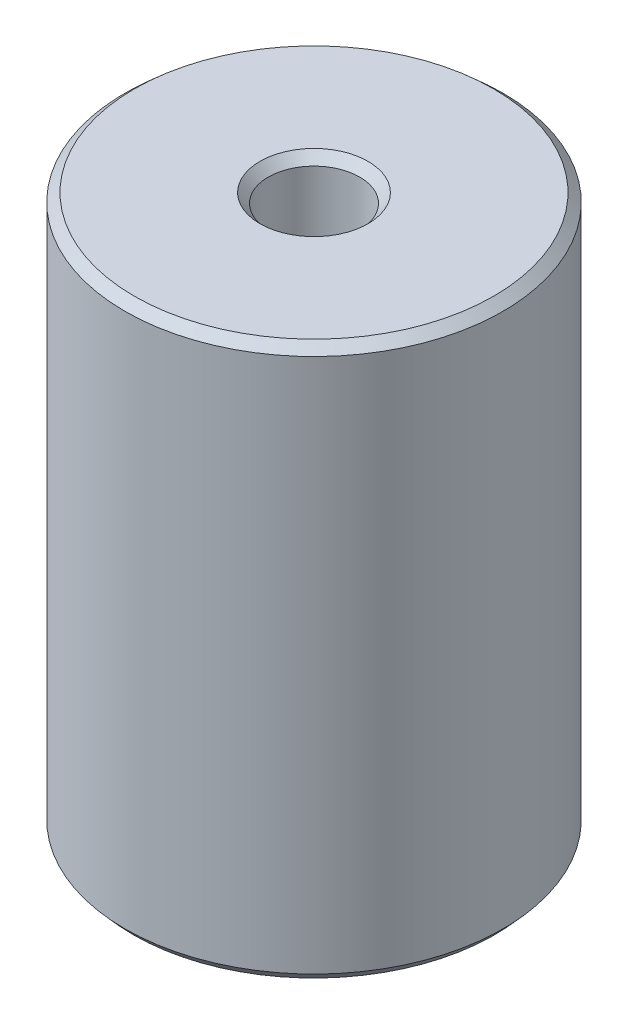
ISO-10303-21;
HEADER;
FILE_DESCRIPTION(('STEP AP214'),'2;1');
FILE_NAME('part.step','',(''),(''),'','','');
FILE_SCHEMA(('AUTOMOTIVE_DESIGN { 1 0 10303 214 1 1 1 1 }'));
ENDSEC;
DATA;
#1=APPLICATION_CONTEXT('core data for automotive mechanical design processes');
#2=APPLICATION_PROTOCOL_DEFINITION('international standard','automotive_design',2000,#1);
#3=PRODUCT_CONTEXT('',#1,'mechanical');
#4=PRODUCT('Part','Part','',(#3));
#5=PRODUCT_RELATED_PRODUCT_CATEGORY('part','',(#4));
#6=PRODUCT_DEFINITION_FORMATION('','',#4);
#7=PRODUCT_DEFINITION_CONTEXT('part definition',#1,'design');
#8=PRODUCT_DEFINITION('design','',#6,#7);
#9=PRODUCT_DEFINITION_SHAPE('','',#8);
#10=(LENGTH_UNIT() NAMED_UNIT(*) SI_UNIT(.MILLI.,.METRE.));
#11=(NAMED_UNIT(*) PLANE_ANGLE_UNIT() SI_UNIT($,.RADIAN.));
#12=(NAMED_UNIT(*) SI_UNIT($,.STERADIAN.) SOLID_ANGLE_UNIT());
#13=UNCERTAINTY_MEASURE_WITH_UNIT(LENGTH_MEASURE(1.E-05),#10,'distance_accuracy_value','');
#14=(GEOMETRIC_REPRESENTATION_CONTEXT(3) GLOBAL_UNCERTAINTY_ASSIGNED_CONTEXT((#13)) GLOBAL_UNIT_ASSIGNED_CONTEXT((#10,
#11,#12)) REPRESENTATION_CONTEXT('',''));
#15=CARTESIAN_POINT('',(0.,0.,0.));
#16=DIRECTION('',(0.,0.,1.));
#17=DIRECTION('',(1.,0.,0.));
#18=AXIS2_PLACEMENT_3D('',#15,#16,#17);
#19=CARTESIAN_POINT('',(0.,14.6188380022093,0.));
#20=DIRECTION('',(0.,-1.,0.));
#21=DIRECTION('',(0.,0.,-1.));
#22=AXIS2_PLACEMENT_3D('',#19,#20,#21);
#23=CYLINDRICAL_SURFACE('',#22,5.);
#24=CARTESIAN_POINT('',(0.,0.248153867948794,0.));
#25=DIRECTION('',(0.,1.,0.));
#26=DIRECTION('',(0.,0.,1.));
#27=AXIS2_PLACEMENT_3D('',#24,#25,#26);
#28=CIRCLE('',#27,5.);
#29=CARTESIAN_POINT('',(0.,0.248153867948792,-5.));
#30=VERTEX_POINT('',#29);
#31=EDGE_CURVE('E10',#30,#30,#28,.T.);
#32=CARTESIAN_POINT('',(0.,14.3967151553673,0.));
#33=DIRECTION('',(0.,1.,0.));
#34=DIRECTION('',(0.,0.,1.));
#35=AXIS2_PLACEMENT_3D('',#32,#33,#34);
#36=CIRCLE('',#35,5.);
#37=CARTESIAN_POINT('',(0.,14.3967151553673,-5.));
#38=VERTEX_POINT('',#37);
#39=EDGE_CURVE('E50',#38,#38,#36,.F.);
#40=CARTESIAN_POINT('',(0.,0.248153867948792,-5.));
#41=CARTESIAN_POINT('',(0.,0.395534714692735,-5.));
#42=CARTESIAN_POINT('',(0.,0.542915561436678,-5.));
#43=CARTESIAN_POINT('',(0.,0.837677254924564,-5.));
#44=CARTESIAN_POINT('',(0.,0.985058101668506,-5.));
#45=CARTESIAN_POINT('',(0.,1.27981979515639,-5.));
#46=CARTESIAN_POINT('',(0.,1.42720064190033,-5.));
#47=CARTESIAN_POINT('',(0.,1.72196233538822,-5.));
#48=CARTESIAN_POINT('',(0.,1.86934318213216,-5.));
#49=CARTESIAN_POINT('',(0.,2.16410487562005,-5.));
#50=CARTESIAN_POINT('',(0.,2.31148572236399,-5.));
#51=CARTESIAN_POINT('',(0.,2.60624741585188,-5.));
#52=CARTESIAN_POINT('',(0.,2.75362826259582,-5.));
#53=CARTESIAN_POINT('',(0.,3.04838995608371,-5.));
#54=CARTESIAN_POINT('',(0.,3.19577080282765,-5.));
#55=CARTESIAN_POINT('',(0.,3.49053249631553,-5.));
#56=CARTESIAN_POINT('',(0.,3.63791334305948,-5.));
#57=CARTESIAN_POINT('',(0.,3.93267503654736,-5.));
#58=CARTESIAN_POINT('',(0.,4.08005588329131,-5.));
#59=CARTESIAN_POINT('',(0.,4.37481757677919,-5.));
#60=CARTESIAN_POINT('',(0.,4.52219842352314,-5.));
#61=CARTESIAN_POINT('',(0.,4.81696011701102,-5.));
#62=CARTESIAN_POINT('',(0.,4.96434096375496,-5.));
#63=CARTESIAN_POINT('',(0.,5.25910265724285,-5.));
#64=CARTESIAN_POINT('',(0.,5.40648350398679,-5.));
#65=CARTESIAN_POINT('',(0.,5.70124519747468,-5.));
#66=CARTESIAN_POINT('',(0.,5.84862604421862,-5.));
#67=CARTESIAN_POINT('',(0.,6.14338773770651,-5.));
#68=CARTESIAN_POINT('',(0.,6.29076858445045,-5.));
#69=CARTESIAN_POINT('',(0.,6.58553027793834,-5.));
#70=CARTESIAN_POINT('',(0.,6.73291112468228,-5.));
#71=CARTESIAN_POINT('',(0.,7.02767281817016,-5.));
#72=CARTESIAN_POINT('',(0.,7.17505366491411,-5.));
#73=CARTESIAN_POINT('',(0.,7.46981535840199,-5.));
#74=CARTESIAN_POINT('',(0.,7.61719620514594,-5.));
#75=CARTESIAN_POINT('',(0.,7.91195789863382,-5.));
#76=CARTESIAN_POINT('',(0.,8.05933874537776,-5.));
#77=CARTESIAN_POINT('',(0.,8.35410043886565,-5.));
#78=CARTESIAN_POINT('',(0.,8.50148128560959,-5.));
#79=CARTESIAN_POINT('',(0.,8.79624297909748,-5.));
#80=CARTESIAN_POINT('',(0.,8.94362382584142,-5.));
#81=CARTESIAN_POINT('',(0.,9.23838551932931,-5.));
#82=CARTESIAN_POINT('',(0.,9.38576636607325,-5.));
#83=CARTESIAN_POINT('',(0.,9.68052805956114,-5.));
#84=CARTESIAN_POINT('',(0.,9.82790890630508,-5.));
#85=CARTESIAN_POINT('',(0.,10.122670599793,-5.));
#86=CARTESIAN_POINT('',(0.,10.2700514465369,-5.));
#87=CARTESIAN_POINT('',(0.,10.5648131400248,-5.));
#88=CARTESIAN_POINT('',(0.,10.7121939867687,-5.));
#89=CARTESIAN_POINT('',(0.,11.0069556802566,-5.));
#90=CARTESIAN_POINT('',(0.,11.1543365270006,-5.));
#91=CARTESIAN_POINT('',(0.,11.4490982204884,-5.));
#92=CARTESIAN_POINT('',(0.,11.5964790672324,-5.));
#93=CARTESIAN_POINT('',(0.,11.8912407607203,-5.));
#94=CARTESIAN_POINT('',(0.,12.0386216074642,-5.));
#95=CARTESIAN_POINT('',(0.,12.3333833009521,-5.));
#96=CARTESIAN_POINT('',(0.,12.480764147696,-5.));
#97=CARTESIAN_POINT('',(0.,12.7755258411839,-5.));
#98=CARTESIAN_POINT('',(0.,12.9229066879279,-5.));
#99=CARTESIAN_POINT('',(0.,13.2176683814158,-5.));
#100=CARTESIAN_POINT('',(0.,13.3650492281597,-5.));
#101=CARTESIAN_POINT('',(0.,13.6598109216476,-5.));
#102=CARTESIAN_POINT('',(0.,13.8071917683915,-5.));
#103=CARTESIAN_POINT('',(0.,14.1019534618794,-5.));
#104=CARTESIAN_POINT('',(0.,14.2493343086234,-5.));
#105=CARTESIAN_POINT('',(0.,14.3967151553673,-5.));
#106=B_SPLINE_CURVE_WITH_KNOTS('',3,(#40,#41,#42,#43,#44,#45,#46,#47,#48,#49,#50,#51,#52,#53,
#54,#55,#56,#57,#58,#59,#60,#61,#62,#63,#64,#65,#66,#67,#68,#69,#70,#71,#72,#73,#74,#75,#76,#77,
#78,#79,#80,#81,#82,#83,#84,#85,#86,#87,#88,#89,#90,#91,#92,#93,#94,#95,#96,#97,#98,#99,#100,
#101,#102,#103,#104,#105),.UNSPECIFIED.,.F.,.F.,(4,2,2,2,2,2,2,2,2,2,2,2,2,2,2,2,2,2,2,2,2,2,2,
2,2,2,2,2,2,2,2,2,4),(0.,0.442142540231829,0.884285080463657,1.32642762069549,1.76857016092732,
2.21071270115914,2.65285524139097,3.0949977816228,3.53714032185463,3.97928286208646,
4.42142540231829,4.86356794255012,5.30571048278194,5.74785302301377,6.1899955632456,
6.63213810347743,7.07428064370926,7.51642318394109,7.95856572417292,8.40070826440474,
8.84285080463657,9.2849933448684,9.72713588510023,10.1692784253321,10.6114209655639,
11.0535635057957,11.4957060460275,11.9378485862594,12.3799911264912,12.822133666723,
13.2642762069549,13.7064187471867,14.1485612874185),.UNSPECIFIED.);
#107=EDGE_CURVE('BSEAM39',#30,#38,#106,.T.);
#108=ORIENTED_EDGE('',*,*,#31,.T.);
#109=ORIENTED_EDGE('',*,*,#39,.T.);
#110=ORIENTED_EDGE('',*,*,#107,.T.);
#111=ORIENTED_EDGE('',*,*,#107,.F.);
#112=EDGE_LOOP('',(#108,#110,#109,#111));
#113=FACE_BOUND('',#112,.T.);
#114=ADVANCED_FACE('F39',(#113),#23,.T.);
#115=CARTESIAN_POINT('',(0.,14.6188380022093,0.));
#116=DIRECTION('',(0.,1.,0.));
#117=DIRECTION('',(0.,0.,1.));
#118=AXIS2_PLACEMENT_3D('',#115,#116,#117);
#119=PLANE('',#118);
#120=CARTESIAN_POINT('',(0.,14.6188380022093,0.));
#121=DIRECTION('',(0.,1.,0.));
#122=DIRECTION('',(0.,0.,1.));
#123=AXIS2_PLACEMENT_3D('',#120,#121,#122);
#124=CIRCLE('',#123,1.42981353982798);
#125=CARTESIAN_POINT('',(0.,14.6188380022093,1.42981353982798));
#126=VERTEX_POINT('',#125);
#127=EDGE_CURVE('E58',#126,#126,#124,.F.);
#128=ORIENTED_EDGE('',*,*,#127,.T.);
#129=EDGE_LOOP('',(#128));
#130=FACE_BOUND('',#129,.T.);
#131=CARTESIAN_POINT('',(0.,14.6188380022093,0.));
#132=DIRECTION('',(0.,1.,0.));
#133=DIRECTION('',(0.,0.,1.));
#134=AXIS2_PLACEMENT_3D('',#131,#132,#133);
#135=CIRCLE('',#134,4.75184613205123);
#136=CARTESIAN_POINT('',(0.,14.6188380022093,-4.75184613205123));
#137=VERTEX_POINT('',#136);
#138=EDGE_CURVE('E61',#137,#137,#135,.T.);
#139=ORIENTED_EDGE('',*,*,#138,.T.);
#140=EDGE_LOOP('',(#139));
#141=FACE_BOUND('',#140,.T.);
#142=ADVANCED_FACE('F88',(#130,#141),#119,.T.);
#143=CARTESIAN_POINT('',(0.,0.,0.));
#144=DIRECTION('',(0.,1.,0.));
#145=DIRECTION('',(0.,0.,1.));
#146=AXIS2_PLACEMENT_3D('',#143,#144,#145);
#147=PLANE('',#146);
#148=CARTESIAN_POINT('',(0.,0.,0.));
#149=DIRECTION('',(0.,1.,0.));
#150=DIRECTION('',(0.,0.,1.));
#151=AXIS2_PLACEMENT_3D('',#148,#149,#150);
#152=CIRCLE('',#151,1.45584456093472);
#153=CARTESIAN_POINT('',(0.,0.,1.45584456093472));
#154=VERTEX_POINT('',#153);
#155=EDGE_CURVE('E51',#154,#154,#152,.T.);
#156=ORIENTED_EDGE('',*,*,#155,.T.);
#157=EDGE_LOOP('',(#156));
#158=FACE_BOUND('',#157,.T.);
#159=CARTESIAN_POINT('',(0.,0.,0.));
#160=DIRECTION('',(0.,1.,0.));
#161=DIRECTION('',(0.,0.,1.));
#162=AXIS2_PLACEMENT_3D('',#159,#160,#161);
#163=CIRCLE('',#162,4.77787715315795);
#164=CARTESIAN_POINT('',(0.,0.,4.77787715315795));
#165=VERTEX_POINT('',#164);
#166=EDGE_CURVE('E54',#165,#165,#163,.F.);
#167=ORIENTED_EDGE('',*,*,#166,.T.);
#168=EDGE_LOOP('',(#167));
#169=FACE_BOUND('',#168,.T.);
#170=ADVANCED_FACE('F83',(#158,#169),#147,.F.);
#171=CARTESIAN_POINT('',(0.,14.6188380022093,0.));
#172=DIRECTION('',(0.,-1.,0.));
#173=DIRECTION('',(0.,0.,-1.));
#174=AXIS2_PLACEMENT_3D('',#171,#172,#173);
#175=CYLINDRICAL_SURFACE('',#174,1.20769069298594);
#176=CARTESIAN_POINT('',(0.,14.3706841342606,0.));
#177=DIRECTION('',(0.,1.,0.));
#178=DIRECTION('',(0.,0.,1.));
#179=AXIS2_PLACEMENT_3D('',#176,#177,#178);
#180=CIRCLE('',#179,1.20769069298594);
#181=CARTESIAN_POINT('',(0.,14.3706841342606,-1.20769069298594));
#182=VERTEX_POINT('',#181);
#183=EDGE_CURVE('E67',#182,#182,#180,.T.);
#184=CARTESIAN_POINT('',(0.,0.222122846842039,0.));
#185=DIRECTION('',(0.,1.,0.));
#186=DIRECTION('',(0.,0.,1.));
#187=AXIS2_PLACEMENT_3D('',#184,#185,#186);
#188=CIRCLE('',#187,1.20769069298594);
#189=CARTESIAN_POINT('',(0.,0.222122846842037,-1.20769069298594));
#190=VERTEX_POINT('',#189);
#191=EDGE_CURVE('E69',#190,#190,#188,.F.);
#192=CARTESIAN_POINT('',(0.,14.3706841342606,-1.20769069298594));
#193=CARTESIAN_POINT('',(0.,14.2233032875166,-1.20769069298594));
#194=CARTESIAN_POINT('',(0.,14.0759224407727,-1.20769069298594));
#195=CARTESIAN_POINT('',(0.,13.7811607472848,-1.20769069298594));
#196=CARTESIAN_POINT('',(0.,13.6337799005408,-1.20769069298594));
#197=CARTESIAN_POINT('',(0.,13.339018207053,-1.20769069298594));
#198=CARTESIAN_POINT('',(0.,13.191637360309,-1.20769069298594));
#199=CARTESIAN_POINT('',(0.,12.8968756668211,-1.20769069298594));
#200=CARTESIAN_POINT('',(0.,12.7494948200772,-1.20769069298594));
#201=CARTESIAN_POINT('',(0.,12.4547331265893,-1.20769069298594));
#202=CARTESIAN_POINT('',(0.,12.3073522798454,-1.20769069298594));
#203=CARTESIAN_POINT('',(0.,12.0125905863575,-1.20769069298594));
#204=CARTESIAN_POINT('',(0.,11.8652097396135,-1.20769069298594));
#205=CARTESIAN_POINT('',(0.,11.5704480461256,-1.20769069298594));
#206=CARTESIAN_POINT('',(0.,11.4230671993817,-1.20769069298594));
#207=CARTESIAN_POINT('',(0.,11.1283055058938,-1.20769069298594));
#208=CARTESIAN_POINT('',(0.,10.9809246591499,-1.20769069298594));
#209=CARTESIAN_POINT('',(0.,10.686162965662,-1.20769069298594));
#210=CARTESIAN_POINT('',(0.,10.538782118918,-1.20769069298594));
#211=CARTESIAN_POINT('',(0.,10.2440204254302,-1.20769069298594));
#212=CARTESIAN_POINT('',(0.,10.0966395786862,-1.20769069298594));
#213=CARTESIAN_POINT('',(0.,9.80187788519833,-1.20769069298594));
#214=CARTESIAN_POINT('',(0.,9.65449703845439,-1.20769069298594));
#215=CARTESIAN_POINT('',(0.,9.3597353449665,-1.20769069298594));
#216=CARTESIAN_POINT('',(0.,9.21235449822256,-1.20769069298594));
#217=CARTESIAN_POINT('',(0.,8.91759280473467,-1.20769069298594));
#218=CARTESIAN_POINT('',(0.,8.77021195799073,-1.20769069298594));
#219=CARTESIAN_POINT('',(0.,8.47545026450284,-1.20769069298594));
#220=CARTESIAN_POINT('',(0.,8.3280694177589,-1.20769069298594));
#221=CARTESIAN_POINT('',(0.,8.03330772427101,-1.20769069298594));
#222=CARTESIAN_POINT('',(0.,7.88592687752707,-1.20769069298594));
#223=CARTESIAN_POINT('',(0.,7.59116518403918,-1.20769069298594));
#224=CARTESIAN_POINT('',(0.,7.44378433729524,-1.20769069298594));
#225=CARTESIAN_POINT('',(0.,7.14902264380736,-1.20769069298594));
#226=CARTESIAN_POINT('',(0.,7.00164179706341,-1.20769069298594));
#227=CARTESIAN_POINT('',(0.,6.70688010357553,-1.20769069298594));
#228=CARTESIAN_POINT('',(0.,6.55949925683158,-1.20769069298594));
#229=CARTESIAN_POINT('',(0.,6.2647375633437,-1.20769069298594));
#230=CARTESIAN_POINT('',(0.,6.11735671659975,-1.20769069298594));
#231=CARTESIAN_POINT('',(0.,5.82259502311187,-1.20769069298594));
#232=CARTESIAN_POINT('',(0.,5.67521417636793,-1.20769069298594));
#233=CARTESIAN_POINT('',(0.,5.38045248288004,-1.20769069298594));
#234=CARTESIAN_POINT('',(0.,5.2330716361361,-1.20769069298594));
#235=CARTESIAN_POINT('',(0.,4.93830994264821,-1.20769069298594));
#236=CARTESIAN_POINT('',(0.,4.79092909590427,-1.20769069298594));
#237=CARTESIAN_POINT('',(0.,4.49616740241638,-1.20769069298594));
#238=CARTESIAN_POINT('',(0.,4.34878655567244,-1.20769069298594));
#239=CARTESIAN_POINT('',(0.,4.05402486218455,-1.20769069298594));
#240=CARTESIAN_POINT('',(0.,3.90664401544061,-1.20769069298594));
#241=CARTESIAN_POINT('',(0.,3.61188232195273,-1.20769069298594));
#242=CARTESIAN_POINT('',(0.,3.46450147520878,-1.20769069298594));
#243=CARTESIAN_POINT('',(0.,3.1697397817209,-1.20769069298594));
#244=CARTESIAN_POINT('',(0.,3.02235893497695,-1.20769069298594));
#245=CARTESIAN_POINT('',(0.,2.72759724148907,-1.20769069298594));
#246=CARTESIAN_POINT('',(0.,2.58021639474512,-1.20769069298594));
#247=CARTESIAN_POINT('',(0.,2.28545470125724,-1.20769069298594));
#248=CARTESIAN_POINT('',(0.,2.1380738545133,-1.20769069298594));
#249=CARTESIAN_POINT('',(0.,1.84331216102541,-1.20769069298594));
#250=CARTESIAN_POINT('',(0.,1.69593131428147,-1.20769069298594));
#251=CARTESIAN_POINT('',(0.,1.40116962079358,-1.20769069298594));
#252=CARTESIAN_POINT('',(0.,1.25378877404964,-1.20769069298594));
#253=CARTESIAN_POINT('',(0.,0.959027080561752,-1.20769069298594));
#254=CARTESIAN_POINT('',(0.,0.811646233817809,-1.20769069298594));
#255=CARTESIAN_POINT('',(0.,0.516884540329924,-1.20769069298594));
#256=CARTESIAN_POINT('',(0.,0.369503693585981,-1.20769069298594));
#257=CARTESIAN_POINT('',(0.,0.222122846842037,-1.20769069298594));
#258=B_SPLINE_CURVE_WITH_KNOTS('',3,(#192,#193,#194,#195,#196,#197,#198,#199,#200,#201,#202,
#203,#204,#205,#206,#207,#208,#209,#210,#211,#212,#213,#214,#215,#216,#217,#218,#219,#220,#221,
#222,#223,#224,#225,#226,#227,#228,#229,#230,#231,#232,#233,#234,#235,#236,#237,#238,#239,#240,
#241,#242,#243,#244,#245,#246,#247,#248,#249,#250,#251,#252,#253,#254,#255,#256,#257),
.UNSPECIFIED.,.F.,.F.,(4,2,2,2,2,2,2,2,2,2,2,2,2,2,2,2,2,2,2,2,2,2,2,2,2,2,2,2,2,2,2,2,4),(0.,
0.442142540231828,0.884285080463657,1.32642762069549,1.76857016092731,2.21071270115914,
2.65285524139097,3.0949977816228,3.53714032185463,3.97928286208646,4.42142540231829,
4.86356794255012,5.30571048278194,5.74785302301377,6.1899955632456,6.63213810347743,
7.07428064370926,7.51642318394109,7.95856572417292,8.40070826440475,8.84285080463657,
9.2849933448684,9.72713588510023,10.1692784253321,10.6114209655639,11.0535635057957,
11.4957060460275,11.9378485862594,12.3799911264912,12.822133666723,13.2642762069549,
13.7064187471867,14.1485612874185),.UNSPECIFIED.);
#259=EDGE_CURVE('BSEAM71',#182,#190,#258,.T.);
#260=ORIENTED_EDGE('',*,*,#183,.T.);
#261=ORIENTED_EDGE('',*,*,#191,.T.);
#262=ORIENTED_EDGE('',*,*,#259,.T.);
#263=ORIENTED_EDGE('',*,*,#259,.F.);
#264=EDGE_LOOP('',(#260,#262,#261,#263));
#265=FACE_BOUND('',#264,.T.);
#266=ADVANCED_FACE('F71',(#265),#175,.F.);
#267=CARTESIAN_POINT('',(0.,14.3706841342606,0.));
#268=DIRECTION('',(0.,1.,0.));
#269=DIRECTION('',(0.,0.,1.));
#270=AXIS2_PLACEMENT_3D('',#267,#268,#269);
#271=CONICAL_SURFACE('',#270,1.20769069298594,0.730102029184634);
#272=ORIENTED_EDGE('',*,*,#127,.F.);
#273=EDGE_LOOP('',(#272));
#274=FACE_BOUND('',#273,.T.);
#275=ORIENTED_EDGE('',*,*,#183,.F.);
#276=EDGE_LOOP('',(#275));
#277=FACE_BOUND('',#276,.T.);
#278=ADVANCED_FACE('F77',(#274,#277),#271,.F.);
#279=CARTESIAN_POINT('',(0.,0.,0.));
#280=DIRECTION('',(0.,-1.,0.));
#281=DIRECTION('',(0.,0.,-1.));
#282=AXIS2_PLACEMENT_3D('',#279,#280,#281);
#283=CONICAL_SURFACE('',#282,1.45584456093472,0.840694297610255);
#284=ORIENTED_EDGE('',*,*,#191,.F.);
#285=EDGE_LOOP('',(#284));
#286=FACE_BOUND('',#285,.T.);
#287=ORIENTED_EDGE('',*,*,#155,.F.);
#288=EDGE_LOOP('',(#287));
#289=FACE_BOUND('',#288,.T.);
#290=ADVANCED_FACE('F73',(#286,#289),#283,.F.);
#291=CARTESIAN_POINT('',(0.,0.248153867948794,0.));
#292=DIRECTION('',(0.,1.,0.));
#293=DIRECTION('',(0.,0.,1.));
#294=AXIS2_PLACEMENT_3D('',#291,#292,#293);
#295=CONICAL_SURFACE('',#294,5.,0.730102029184637);
#296=ORIENTED_EDGE('',*,*,#166,.F.);
#297=EDGE_LOOP('',(#296));
#298=FACE_BOUND('',#297,.T.);
#299=ORIENTED_EDGE('',*,*,#31,.F.);
#300=EDGE_LOOP('',(#299));
#301=FACE_BOUND('',#300,.T.);
#302=ADVANCED_FACE('F76',(#298,#301),#295,.T.);
#303=CARTESIAN_POINT('',(0.,14.6188380022093,0.));
#304=DIRECTION('',(0.,-1.,0.));
#305=DIRECTION('',(0.,0.,-1.));
#306=AXIS2_PLACEMENT_3D('',#303,#304,#305);
#307=CONICAL_SURFACE('',#306,4.75184613205123,0.840694297610264);
#308=CARTESIAN_POINT('',(0.,14.3967151553673,-5.));
#309=CARTESIAN_POINT('',(0.,14.3990289350219,-4.99741506387554));
#310=CARTESIAN_POINT('',(0.,14.4013427146765,-4.99483012775107));
#311=CARTESIAN_POINT('',(0.,14.4059702739857,-4.98966025550214));
#312=CARTESIAN_POINT('',(0.,14.4082840536403,-4.98707531937767));
#313=CARTESIAN_POINT('',(0.,14.4129116129495,-4.98190544712874));
#314=CARTESIAN_POINT('',(0.,14.4152253926041,-4.97932051100427));
#315=CARTESIAN_POINT('',(0.,14.4198529519134,-4.97415063875534));
#316=CARTESIAN_POINT('',(0.,14.422166731568,-4.97156570263087));
#317=CARTESIAN_POINT('',(0.,14.4267942908772,-4.96639583038194));
#318=CARTESIAN_POINT('',(0.,14.4291080705318,-4.96381089425747));
#319=CARTESIAN_POINT('',(0.,14.433735629841,-4.95864102200854));
#320=CARTESIAN_POINT('',(0.,14.4360494094956,-4.95605608588407));
#321=CARTESIAN_POINT('',(0.,14.4406769688048,-4.95088621363514));
#322=CARTESIAN_POINT('',(0.,14.4429907484594,-4.94830127751067));
#323=CARTESIAN_POINT('',(0.,14.4476183077686,-4.94313140526174));
#324=CARTESIAN_POINT('',(0.,14.4499320874232,-4.94054646913727));
#325=CARTESIAN_POINT('',(0.,14.4545596467324,-4.93537659688834));
#326=CARTESIAN_POINT('',(0.,14.456873426387,-4.93279166076387));
#327=CARTESIAN_POINT('',(0.,14.4615009856962,-4.92762178851494));
#328=CARTESIAN_POINT('',(0.,14.4638147653508,-4.92503685239048));
#329=CARTESIAN_POINT('',(0.,14.46844232466,-4.91986698014154));
#330=CARTESIAN_POINT('',(0.,14.4707561043147,-4.91728204401708));
#331=CARTESIAN_POINT('',(0.,14.4753836636239,-4.91211217176814));
#332=CARTESIAN_POINT('',(0.,14.4776974432785,-4.90952723564368));
#333=CARTESIAN_POINT('',(0.,14.4823250025877,-4.90435736339475));
#334=CARTESIAN_POINT('',(0.,14.4846387822423,-4.90177242727028));
#335=CARTESIAN_POINT('',(0.,14.4892663415515,-4.89660255502135));
#336=CARTESIAN_POINT('',(0.,14.4915801212061,-4.89401761889688));
#337=CARTESIAN_POINT('',(0.,14.4962076805153,-4.88884774664795));
#338=CARTESIAN_POINT('',(0.,14.4985214601699,-4.88626281052348));
#339=CARTESIAN_POINT('',(0.,14.5031490194791,-4.88109293827455));
#340=CARTESIAN_POINT('',(0.,14.5054627991337,-4.87850800215008));
#341=CARTESIAN_POINT('',(0.,14.5100903584429,-4.87333812990115));
#342=CARTESIAN_POINT('',(0.,14.5124041380975,-4.87075319377668));
#343=CARTESIAN_POINT('',(0.,14.5170316974067,-4.86558332152775));
#344=CARTESIAN_POINT('',(0.,14.5193454770613,-4.86299838540328));
#345=CARTESIAN_POINT('',(0.,14.5239730363706,-4.85782851315435));
#346=CARTESIAN_POINT('',(0.,14.5262868160252,-4.85524357702988));
#347=CARTESIAN_POINT('',(0.,14.5309143753344,-4.85007370478095));
#348=CARTESIAN_POINT('',(0.,14.533228154989,-4.84748876865648));
#349=CARTESIAN_POINT('',(0.,14.5378557142982,-4.84231889640755));
#350=CARTESIAN_POINT('',(0.,14.5401694939528,-4.83973396028309));
#351=CARTESIAN_POINT('',(0.,14.544797053262,-4.83456408803415));
#352=CARTESIAN_POINT('',(0.,14.5471108329166,-4.83197915190969));
#353=CARTESIAN_POINT('',(0.,14.5517383922258,-4.82680927966075));
#354=CARTESIAN_POINT('',(0.,14.5540521718804,-4.82422434353629));
#355=CARTESIAN_POINT('',(0.,14.5586797311896,-4.81905447128735));
#356=CARTESIAN_POINT('',(0.,14.5609935108442,-4.81646953516289));
#357=CARTESIAN_POINT('',(0.,14.5656210701534,-4.81129966291396));
#358=CARTESIAN_POINT('',(0.,14.567934849808,-4.80871472678949));
#359=CARTESIAN_POINT('',(0.,14.5725624091173,-4.80354485454056));
#360=CARTESIAN_POINT('',(0.,14.5748761887719,-4.80095991841609));
#361=CARTESIAN_POINT('',(0.,14.5795037480811,-4.79579004616716));
#362=CARTESIAN_POINT('',(0.,14.5818175277357,-4.79320511004269));
#363=CARTESIAN_POINT('',(0.,14.5864450870449,-4.78803523779376));
#364=CARTESIAN_POINT('',(0.,14.5887588666995,-4.78545030166929));
#365=CARTESIAN_POINT('',(0.,14.5933864260087,-4.78028042942036));
#366=CARTESIAN_POINT('',(0.,14.5957002056633,-4.77769549329589));
#367=CARTESIAN_POINT('',(0.,14.6003277649725,-4.77252562104696));
#368=CARTESIAN_POINT('',(0.,14.6026415446271,-4.76994068492249));
#369=CARTESIAN_POINT('',(0.,14.6072691039363,-4.76477081267356));
#370=CARTESIAN_POINT('',(0.,14.6095828835909,-4.76218587654909));
#371=CARTESIAN_POINT('',(0.,14.6142104429001,-4.75701600430016));
#372=CARTESIAN_POINT('',(0.,14.6165242225547,-4.75443106817569));
#373=CARTESIAN_POINT('',(0.,14.6188380022093,-4.75184613205123));
#374=B_SPLINE_CURVE_WITH_KNOTS('',3,(#308,#309,#310,#311,#312,#313,#314,#315,#316,#317,#318,
#319,#320,#321,#322,#323,#324,#325,#326,#327,#328,#329,#330,#331,#332,#333,#334,#335,#336,#337,
#338,#339,#340,#341,#342,#343,#344,#345,#346,#347,#348,#349,#350,#351,#352,#353,#354,#355,#356,
#357,#358,#359,#360,#361,#362,#363,#364,#365,#366,#367,#368,#369,#370,#371,#372,#373),
.UNSPECIFIED.,.F.,.F.,(4,2,2,2,2,2,2,2,2,2,2,2,2,2,2,2,2,2,2,2,2,2,2,2,2,2,2,2,2,2,2,2,4),(0.,
0.0104076529303535,0.020815305860707,0.0312229587910605,0.0416306117214139,0.0520382646517674,
0.0624459175821216,0.072853570512475,0.0832612234428285,0.093668876373182,0.104076529303536,
0.114484182233889,0.124891835164244,0.135299488094596,0.145707141024951,0.156114793955304,
0.166522446885657,0.176930099816011,0.187337752746364,0.197745405676718,0.208153058607071,
0.218560711537424,0.228968364467779,0.239376017398132,0.249783670328487,0.26019132325884,
0.270598976189194,0.281006629119547,0.291414282049901,0.301821934980255,0.312229587910608,
0.322637240840962,0.333044893771315),.UNSPECIFIED.);
#375=EDGE_CURVE('BSEAM45',#38,#137,#374,.T.);
#376=ORIENTED_EDGE('',*,*,#39,.F.);
#377=ORIENTED_EDGE('',*,*,#138,.F.);
#378=ORIENTED_EDGE('',*,*,#375,.T.);
#379=ORIENTED_EDGE('',*,*,#375,.F.);
#380=EDGE_LOOP('',(#376,#378,#377,#379));
#381=FACE_BOUND('',#380,.T.);
#382=ADVANCED_FACE('F45',(#381),#307,.T.);
#383=CLOSED_SHELL('',(#114,#142,#170,#266,#278,#290,#302,#382));
#384=MANIFOLD_SOLID_BREP('B2',#383);
#385=ADVANCED_BREP_SHAPE_REPRESENTATION('',(#18,#384),#14);
#386=SHAPE_DEFINITION_REPRESENTATION(#9,#385);
ENDSEC;
END-ISO-10303-21;
